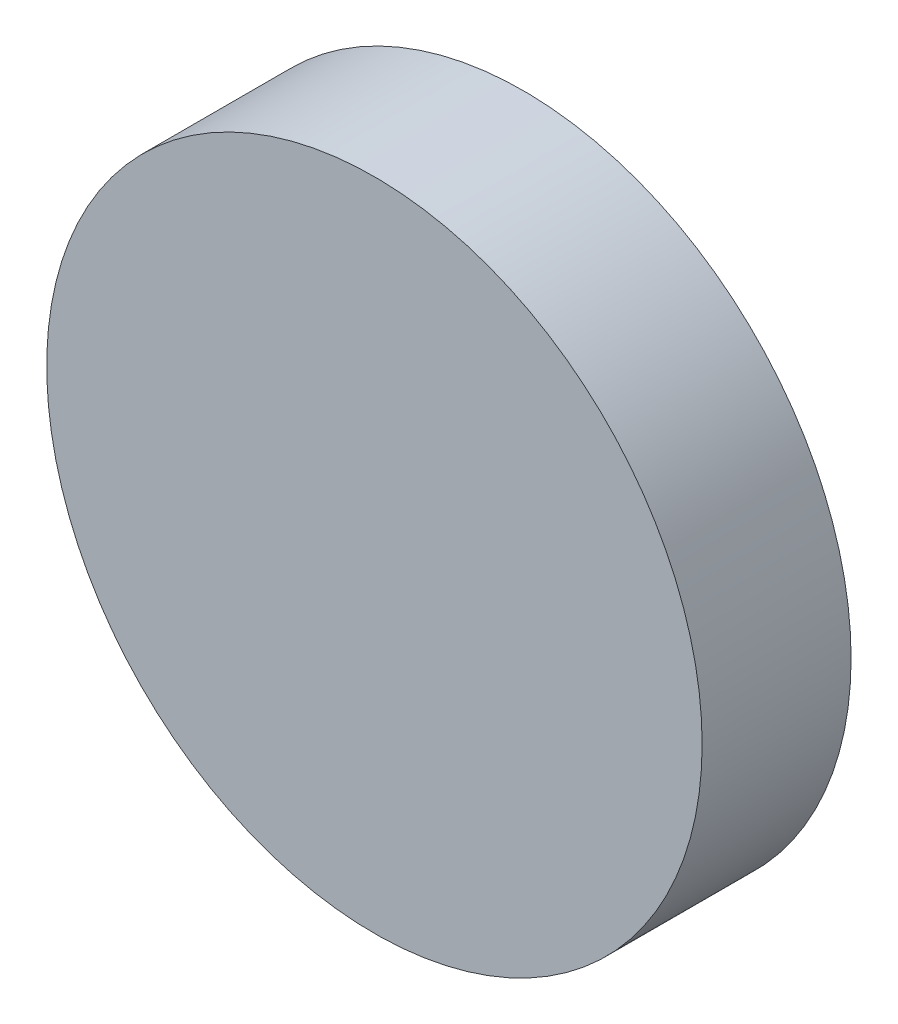
ISO-10303-21;
HEADER;
FILE_DESCRIPTION(('STEP AP214'),'2;1');
FILE_NAME('part.step','',(''),(''),'','','');
FILE_SCHEMA(('AUTOMOTIVE_DESIGN { 1 0 10303 214 1 1 1 1 }'));
ENDSEC;
DATA;
#1=APPLICATION_CONTEXT('core data for automotive mechanical design processes');
#2=APPLICATION_PROTOCOL_DEFINITION('international standard','automotive_design',2000,#1);
#3=PRODUCT_CONTEXT('',#1,'mechanical');
#4=PRODUCT('Part','Part','',(#3));
#5=PRODUCT_RELATED_PRODUCT_CATEGORY('part','',(#4));
#6=PRODUCT_DEFINITION_FORMATION('','',#4);
#7=PRODUCT_DEFINITION_CONTEXT('part definition',#1,'design');
#8=PRODUCT_DEFINITION('design','',#6,#7);
#9=PRODUCT_DEFINITION_SHAPE('','',#8);
#10=(LENGTH_UNIT() NAMED_UNIT(*) SI_UNIT(.MILLI.,.METRE.));
#11=(NAMED_UNIT(*) PLANE_ANGLE_UNIT() SI_UNIT($,.RADIAN.));
#12=(NAMED_UNIT(*) SI_UNIT($,.STERADIAN.) SOLID_ANGLE_UNIT());
#13=UNCERTAINTY_MEASURE_WITH_UNIT(LENGTH_MEASURE(1.E-05),#10,'distance_accuracy_value','');
#14=(GEOMETRIC_REPRESENTATION_CONTEXT(3) GLOBAL_UNCERTAINTY_ASSIGNED_CONTEXT((#13)) GLOBAL_UNIT_ASSIGNED_CONTEXT((#10,
#11,#12)) REPRESENTATION_CONTEXT('',''));
#15=CARTESIAN_POINT('',(0.,0.,0.));
#16=DIRECTION('',(0.,0.,1.));
#17=DIRECTION('',(1.,0.,0.));
#18=AXIS2_PLACEMENT_3D('',#15,#16,#17);
#19=CARTESIAN_POINT('',(3.96922861795103,0.,40.0589901350258));
#20=DIRECTION('',(0.,-1.,0.));
#21=DIRECTION('',(1.,0.,0.));
#22=AXIS2_PLACEMENT_3D('',#19,#20,#21);
#23=CIRCLE('',#22,53.207247720309);
#24=TRIMMED_CURVE('',#23,(PARAMETER_VALUE(-1.64546508987266)),
(PARAMETER_VALUE(1.64546508987266)),.T.,.PARAMETER.);
#25=CARTESIAN_POINT('',(0.,0.,40.0589901350258));
#26=DIRECTION('',(0.,0.,1.));
#27=AXIS1_PLACEMENT('',#25,#26);
#28=SURFACE_OF_REVOLUTION('',#24,#27);
#29=CARTESIAN_POINT('',(0.,0.,-10.));
#30=DIRECTION('',(0.,0.,1.));
#31=DIRECTION('',(1.,0.,0.));
#32=AXIS2_PLACEMENT_3D('',#29,#30,#31);
#33=CIRCLE('',#32,22.);
#34=CARTESIAN_POINT('',(22.,0.,-10.));
#35=VERTEX_POINT('',#34);
#36=EDGE_CURVE('E11',#35,#35,#33,.T.);
#37=ORIENTED_EDGE('',*,*,#36,.F.);
#38=EDGE_LOOP('',(#37));
#39=FACE_BOUND('',#38,.T.);
#40=CARTESIAN_POINT('',(0.,0.,-13.));
#41=VERTEX_POINT('',#40);
#42=VERTEX_LOOP('',#41);
#43=FACE_BOUND('',#42,.T.);
#44=ADVANCED_FACE('F35',(#39,#43),#28,.T.);
#45=CARTESIAN_POINT('',(0.,0.,0.));
#46=DIRECTION('',(0.,0.,1.));
#47=DIRECTION('',(1.,0.,0.));
#48=AXIS2_PLACEMENT_3D('',#45,#46,#47);
#49=CYLINDRICAL_SURFACE('',#48,22.);
#50=CARTESIAN_POINT('',(0.,0.,0.));
#51=DIRECTION('',(0.,0.,1.));
#52=DIRECTION('',(1.,0.,0.));
#53=AXIS2_PLACEMENT_3D('',#50,#51,#52);
#54=CIRCLE('',#53,22.);
#55=CARTESIAN_POINT('',(22.,0.,0.));
#56=VERTEX_POINT('',#55);
#57=EDGE_CURVE('E41',#56,#56,#54,.T.);
#58=ORIENTED_EDGE('',*,*,#57,.F.);
#59=EDGE_LOOP('',(#58));
#60=FACE_BOUND('',#59,.T.);
#61=ORIENTED_EDGE('',*,*,#36,.T.);
#62=EDGE_LOOP('',(#61));
#63=FACE_BOUND('',#62,.T.);
#64=ADVANCED_FACE('F45',(#60,#63),#49,.T.);
#65=CARTESIAN_POINT('',(0.,0.,0.));
#66=DIRECTION('',(0.,0.,-1.));
#67=DIRECTION('',(-1.,0.,0.));
#68=AXIS2_PLACEMENT_3D('',#65,#66,#67);
#69=PLANE('',#68);
#70=ORIENTED_EDGE('',*,*,#57,.T.);
#71=EDGE_LOOP('',(#70));
#72=FACE_BOUND('',#71,.T.);
#73=ADVANCED_FACE('F50',(#72),#69,.F.);
#74=CLOSED_SHELL('',(#44,#64,#73));
#75=MANIFOLD_SOLID_BREP('B2',#74);
#76=ADVANCED_BREP_SHAPE_REPRESENTATION('',(#18,#75),#14);
#77=SHAPE_DEFINITION_REPRESENTATION(#9,#76);
ENDSEC;
END-ISO-10303-21;
